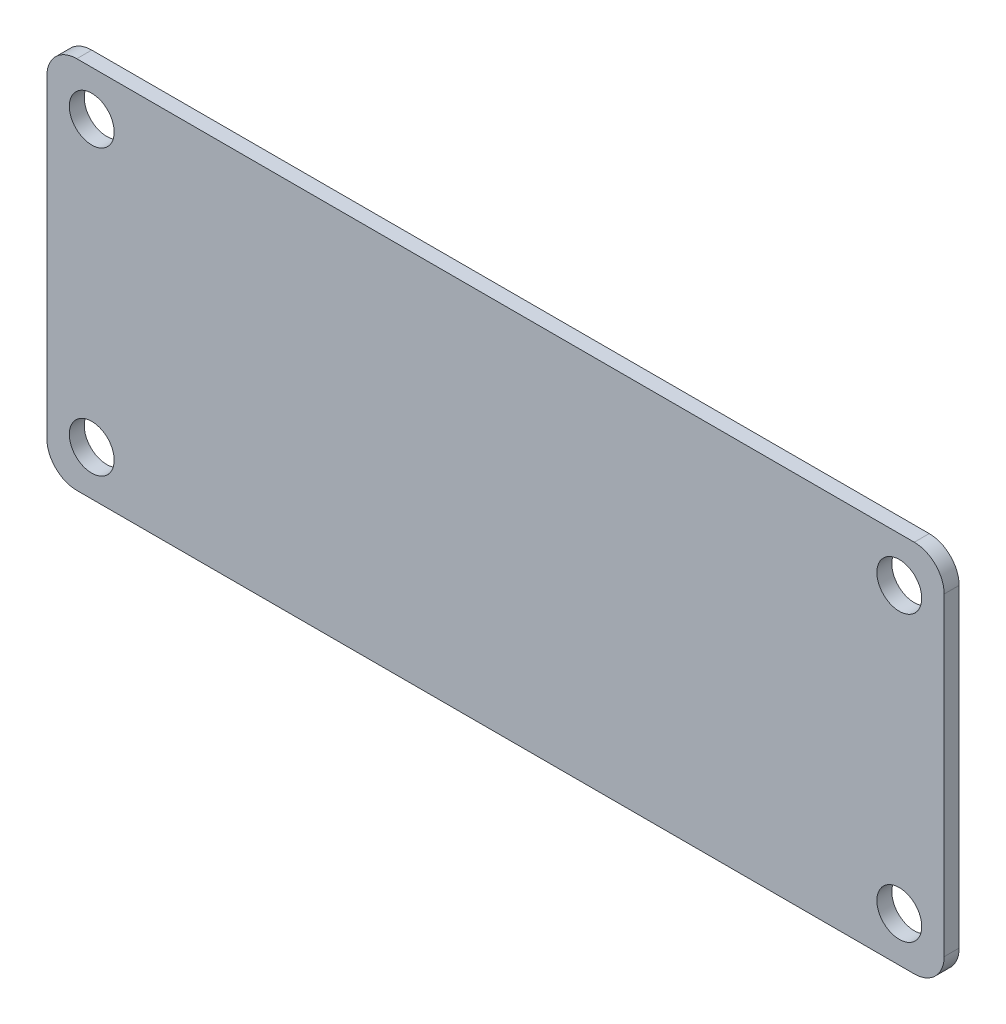
ISO-10303-21;
HEADER;
FILE_DESCRIPTION(('STEP AP214'),'2;1');
FILE_NAME('part.step','',(''),(''),'','','');
FILE_SCHEMA(('AUTOMOTIVE_DESIGN { 1 0 10303 214 1 1 1 1 }'));
ENDSEC;
DATA;
#1=APPLICATION_CONTEXT('core data for automotive mechanical design processes');
#2=APPLICATION_PROTOCOL_DEFINITION('international standard','automotive_design',2000,#1);
#3=PRODUCT_CONTEXT('',#1,'mechanical');
#4=PRODUCT('Part','Part','',(#3));
#5=PRODUCT_RELATED_PRODUCT_CATEGORY('part','',(#4));
#6=PRODUCT_DEFINITION_FORMATION('','',#4);
#7=PRODUCT_DEFINITION_CONTEXT('part definition',#1,'design');
#8=PRODUCT_DEFINITION('design','',#6,#7);
#9=PRODUCT_DEFINITION_SHAPE('','',#8);
#10=(LENGTH_UNIT() NAMED_UNIT(*) SI_UNIT(.MILLI.,.METRE.));
#11=(NAMED_UNIT(*) PLANE_ANGLE_UNIT() SI_UNIT($,.RADIAN.));
#12=(NAMED_UNIT(*) SI_UNIT($,.STERADIAN.) SOLID_ANGLE_UNIT());
#13=UNCERTAINTY_MEASURE_WITH_UNIT(LENGTH_MEASURE(1.E-05),#10,'distance_accuracy_value','');
#14=(GEOMETRIC_REPRESENTATION_CONTEXT(3) GLOBAL_UNCERTAINTY_ASSIGNED_CONTEXT((#13)) GLOBAL_UNIT_ASSIGNED_CONTEXT((#10,
#11,#12)) REPRESENTATION_CONTEXT('',''));
#15=CARTESIAN_POINT('',(0.,0.,0.));
#16=DIRECTION('',(0.,0.,1.));
#17=DIRECTION('',(1.,0.,0.));
#18=AXIS2_PLACEMENT_3D('',#15,#16,#17);
#19=CARTESIAN_POINT('',(-30.,12.5,1.));
#20=DIRECTION('',(1.,0.,0.));
#21=DIRECTION('',(0.,1.,0.));
#22=AXIS2_PLACEMENT_3D('',#19,#20,#21);
#23=PLANE('',#22);
#24=DIRECTION('',(0.,-1.,0.));
#25=VECTOR('',#24,1.);
#26=CARTESIAN_POINT('',(-30.,12.5,0.));
#27=LINE('',#26,#25);
#28=CARTESIAN_POINT('',(-30.,10.5,0.));
#29=VERTEX_POINT('',#28);
#30=CARTESIAN_POINT('',(-30.,-10.5,0.));
#31=VERTEX_POINT('',#30);
#32=EDGE_CURVE('E129',#29,#31,#27,.T.);
#33=ORIENTED_EDGE('',*,*,#32,.T.);
#34=DIRECTION('',(0.,0.,-1.));
#35=VECTOR('',#34,1.);
#36=CARTESIAN_POINT('',(-30.,-10.5,1.));
#37=LINE('',#36,#35);
#38=CARTESIAN_POINT('',(-30.,-10.5,1.));
#39=VERTEX_POINT('',#38);
#40=EDGE_CURVE('E11',#31,#39,#37,.F.);
#41=ORIENTED_EDGE('',*,*,#40,.T.);
#42=DIRECTION('',(0.,-1.,0.));
#43=VECTOR('',#42,1.);
#44=CARTESIAN_POINT('',(-30.,12.5,1.));
#45=LINE('',#44,#43);
#46=CARTESIAN_POINT('',(-30.,10.5,1.));
#47=VERTEX_POINT('',#46);
#48=EDGE_CURVE('E127',#47,#39,#45,.T.);
#49=ORIENTED_EDGE('',*,*,#48,.F.);
#50=DIRECTION('',(0.,0.,-1.));
#51=VECTOR('',#50,1.);
#52=CARTESIAN_POINT('',(-30.,10.5,1.));
#53=LINE('',#52,#51);
#54=EDGE_CURVE('E41',#47,#29,#53,.T.);
#55=ORIENTED_EDGE('',*,*,#54,.T.);
#56=EDGE_LOOP('',(#33,#41,#49,#55));
#57=FACE_BOUND('',#56,.T.);
#58=ADVANCED_FACE('F33',(#57),#23,.F.);
#59=CARTESIAN_POINT('',(-30.,-12.5,1.));
#60=DIRECTION('',(0.,1.,0.));
#61=DIRECTION('',(0.,0.,1.));
#62=AXIS2_PLACEMENT_3D('',#59,#60,#61);
#63=PLANE('',#62);
#64=DIRECTION('',(1.,0.,0.));
#65=VECTOR('',#64,1.);
#66=CARTESIAN_POINT('',(-30.,-12.5,0.));
#67=LINE('',#66,#65);
#68=CARTESIAN_POINT('',(-28.,-12.5,0.));
#69=VERTEX_POINT('',#68);
#70=CARTESIAN_POINT('',(28.,-12.5,0.));
#71=VERTEX_POINT('',#70);
#72=EDGE_CURVE('E125',#69,#71,#67,.T.);
#73=ORIENTED_EDGE('',*,*,#72,.T.);
#74=DIRECTION('',(0.,0.,-1.));
#75=VECTOR('',#74,1.);
#76=CARTESIAN_POINT('',(28.,-12.5,1.));
#77=LINE('',#76,#75);
#78=CARTESIAN_POINT('',(28.,-12.5,1.));
#79=VERTEX_POINT('',#78);
#80=EDGE_CURVE('E104',#71,#79,#77,.F.);
#81=ORIENTED_EDGE('',*,*,#80,.T.);
#82=DIRECTION('',(1.,0.,0.));
#83=VECTOR('',#82,1.);
#84=CARTESIAN_POINT('',(-30.,-12.5,1.));
#85=LINE('',#84,#83);
#86=CARTESIAN_POINT('',(-28.,-12.5,1.));
#87=VERTEX_POINT('',#86);
#88=EDGE_CURVE('E169',#87,#79,#85,.T.);
#89=ORIENTED_EDGE('',*,*,#88,.F.);
#90=DIRECTION('',(0.,0.,-1.));
#91=VECTOR('',#90,1.);
#92=CARTESIAN_POINT('',(-28.,-12.5,1.));
#93=LINE('',#92,#91);
#94=EDGE_CURVE('E109',#87,#69,#93,.T.);
#95=ORIENTED_EDGE('',*,*,#94,.T.);
#96=EDGE_LOOP('',(#73,#81,#89,#95));
#97=FACE_BOUND('',#96,.T.);
#98=ADVANCED_FACE('F217',(#97),#63,.F.);
#99=CARTESIAN_POINT('',(30.,12.5,1.));
#100=DIRECTION('',(-1.,0.,0.));
#101=DIRECTION('',(0.,-1.,0.));
#102=AXIS2_PLACEMENT_3D('',#99,#100,#101);
#103=PLANE('',#102);
#104=DIRECTION('',(0.,1.,0.));
#105=VECTOR('',#104,1.);
#106=CARTESIAN_POINT('',(30.,12.5,1.));
#107=LINE('',#106,#105);
#108=CARTESIAN_POINT('',(30.,-10.5,1.));
#109=VERTEX_POINT('',#108);
#110=CARTESIAN_POINT('',(30.,10.5,1.));
#111=VERTEX_POINT('',#110);
#112=EDGE_CURVE('E118',#109,#111,#107,.T.);
#113=ORIENTED_EDGE('',*,*,#112,.F.);
#114=DIRECTION('',(0.,0.,-1.));
#115=VECTOR('',#114,1.);
#116=CARTESIAN_POINT('',(30.,-10.5,1.));
#117=LINE('',#116,#115);
#118=CARTESIAN_POINT('',(30.,-10.5,0.));
#119=VERTEX_POINT('',#118);
#120=EDGE_CURVE('E103',#109,#119,#117,.T.);
#121=ORIENTED_EDGE('',*,*,#120,.T.);
#122=DIRECTION('',(0.,1.,0.));
#123=VECTOR('',#122,1.);
#124=CARTESIAN_POINT('',(30.,12.5,0.));
#125=LINE('',#124,#123);
#126=CARTESIAN_POINT('',(30.,10.5,0.));
#127=VERTEX_POINT('',#126);
#128=EDGE_CURVE('E116',#119,#127,#125,.T.);
#129=ORIENTED_EDGE('',*,*,#128,.T.);
#130=DIRECTION('',(0.,0.,-1.));
#131=VECTOR('',#130,1.);
#132=CARTESIAN_POINT('',(30.,10.5,1.));
#133=LINE('',#132,#131);
#134=EDGE_CURVE('E120',#127,#111,#133,.F.);
#135=ORIENTED_EDGE('',*,*,#134,.T.);
#136=EDGE_LOOP('',(#113,#121,#129,#135));
#137=FACE_BOUND('',#136,.T.);
#138=ADVANCED_FACE('F115',(#137),#103,.F.);
#139=CARTESIAN_POINT('',(-30.,12.5,1.));
#140=DIRECTION('',(0.,-1.,0.));
#141=DIRECTION('',(0.,0.,-1.));
#142=AXIS2_PLACEMENT_3D('',#139,#140,#141);
#143=PLANE('',#142);
#144=DIRECTION('',(-1.,0.,0.));
#145=VECTOR('',#144,1.);
#146=CARTESIAN_POINT('',(-30.,12.5,1.));
#147=LINE('',#146,#145);
#148=CARTESIAN_POINT('',(28.,12.5,1.));
#149=VERTEX_POINT('',#148);
#150=CARTESIAN_POINT('',(-28.,12.5,1.));
#151=VERTEX_POINT('',#150);
#152=EDGE_CURVE('E133',#149,#151,#147,.T.);
#153=ORIENTED_EDGE('',*,*,#152,.F.);
#154=DIRECTION('',(0.,0.,-1.));
#155=VECTOR('',#154,1.);
#156=CARTESIAN_POINT('',(28.,12.5,1.));
#157=LINE('',#156,#155);
#158=CARTESIAN_POINT('',(28.,12.5,0.));
#159=VERTEX_POINT('',#158);
#160=EDGE_CURVE('E150',#149,#159,#157,.T.);
#161=ORIENTED_EDGE('',*,*,#160,.T.);
#162=DIRECTION('',(-1.,0.,0.));
#163=VECTOR('',#162,1.);
#164=CARTESIAN_POINT('',(-30.,12.5,0.));
#165=LINE('',#164,#163);
#166=CARTESIAN_POINT('',(-28.,12.5,0.));
#167=VERTEX_POINT('',#166);
#168=EDGE_CURVE('E124',#159,#167,#165,.T.);
#169=ORIENTED_EDGE('',*,*,#168,.T.);
#170=DIRECTION('',(0.,0.,-1.));
#171=VECTOR('',#170,1.);
#172=CARTESIAN_POINT('',(-28.,12.5,1.));
#173=LINE('',#172,#171);
#174=EDGE_CURVE('E48',#167,#151,#173,.F.);
#175=ORIENTED_EDGE('',*,*,#174,.T.);
#176=EDGE_LOOP('',(#153,#161,#169,#175));
#177=FACE_BOUND('',#176,.T.);
#178=ADVANCED_FACE('F206',(#177),#143,.F.);
#179=CARTESIAN_POINT('',(0.,0.,1.));
#180=DIRECTION('',(0.,0.,1.));
#181=DIRECTION('',(1.,0.,0.));
#182=AXIS2_PLACEMENT_3D('',#179,#180,#181);
#183=PLANE('',#182);
#184=CARTESIAN_POINT('',(27.,9.5,1.));
#185=DIRECTION('',(0.,0.,1.));
#186=DIRECTION('',(1.,0.,0.));
#187=AXIS2_PLACEMENT_3D('',#184,#185,#186);
#188=CIRCLE('',#187,1.5);
#189=CARTESIAN_POINT('',(28.5,9.5,1.));
#190=VERTEX_POINT('',#189);
#191=EDGE_CURVE('E188',#190,#190,#188,.T.);
#192=ORIENTED_EDGE('',*,*,#191,.F.);
#193=EDGE_LOOP('',(#192));
#194=FACE_BOUND('',#193,.T.);
#195=CARTESIAN_POINT('',(-27.,-9.5,1.));
#196=DIRECTION('',(0.,0.,1.));
#197=DIRECTION('',(1.,0.,0.));
#198=AXIS2_PLACEMENT_3D('',#195,#196,#197);
#199=CIRCLE('',#198,1.5);
#200=CARTESIAN_POINT('',(-25.5,-9.5,1.));
#201=VERTEX_POINT('',#200);
#202=EDGE_CURVE('E182',#201,#201,#199,.T.);
#203=ORIENTED_EDGE('',*,*,#202,.F.);
#204=EDGE_LOOP('',(#203));
#205=FACE_BOUND('',#204,.T.);
#206=CARTESIAN_POINT('',(27.,-9.5,1.));
#207=DIRECTION('',(0.,0.,1.));
#208=DIRECTION('',(1.,0.,0.));
#209=AXIS2_PLACEMENT_3D('',#206,#207,#208);
#210=CIRCLE('',#209,1.5);
#211=CARTESIAN_POINT('',(28.5,-9.5,1.));
#212=VERTEX_POINT('',#211);
#213=EDGE_CURVE('E176',#212,#212,#210,.T.);
#214=ORIENTED_EDGE('',*,*,#213,.F.);
#215=EDGE_LOOP('',(#214));
#216=FACE_BOUND('',#215,.T.);
#217=CARTESIAN_POINT('',(-27.,9.5,1.));
#218=DIRECTION('',(0.,0.,1.));
#219=DIRECTION('',(1.,0.,0.));
#220=AXIS2_PLACEMENT_3D('',#217,#218,#219);
#221=CIRCLE('',#220,1.5);
#222=CARTESIAN_POINT('',(-25.5,9.5,1.));
#223=VERTEX_POINT('',#222);
#224=EDGE_CURVE('E164',#223,#223,#221,.T.);
#225=ORIENTED_EDGE('',*,*,#224,.F.);
#226=EDGE_LOOP('',(#225));
#227=FACE_BOUND('',#226,.T.);
#228=ORIENTED_EDGE('',*,*,#88,.T.);
#229=CARTESIAN_POINT('',(28.,-10.5,1.));
#230=DIRECTION('',(0.,0.,1.));
#231=DIRECTION('',(1.,0.,0.));
#232=AXIS2_PLACEMENT_3D('',#229,#230,#231);
#233=CIRCLE('',#232,2.);
#234=EDGE_CURVE('E147',#79,#109,#233,.T.);
#235=ORIENTED_EDGE('',*,*,#234,.T.);
#236=ORIENTED_EDGE('',*,*,#112,.T.);
#237=CARTESIAN_POINT('',(28.,10.5,1.));
#238=DIRECTION('',(0.,0.,1.));
#239=DIRECTION('',(1.,0.,0.));
#240=AXIS2_PLACEMENT_3D('',#237,#238,#239);
#241=CIRCLE('',#240,2.);
#242=EDGE_CURVE('E55',#111,#149,#241,.T.);
#243=ORIENTED_EDGE('',*,*,#242,.T.);
#244=ORIENTED_EDGE('',*,*,#152,.T.);
#245=CARTESIAN_POINT('',(-28.,10.5,1.));
#246=DIRECTION('',(0.,0.,1.));
#247=DIRECTION('',(1.,0.,0.));
#248=AXIS2_PLACEMENT_3D('',#245,#246,#247);
#249=CIRCLE('',#248,2.);
#250=EDGE_CURVE('E142',#151,#47,#249,.T.);
#251=ORIENTED_EDGE('',*,*,#250,.T.);
#252=ORIENTED_EDGE('',*,*,#48,.T.);
#253=CARTESIAN_POINT('',(-28.,-10.5,1.));
#254=DIRECTION('',(0.,0.,1.));
#255=DIRECTION('',(1.,0.,0.));
#256=AXIS2_PLACEMENT_3D('',#253,#254,#255);
#257=CIRCLE('',#256,2.);
#258=EDGE_CURVE('E144',#39,#87,#257,.T.);
#259=ORIENTED_EDGE('',*,*,#258,.T.);
#260=EDGE_LOOP('',(#228,#235,#236,#243,#244,#251,#252,#259));
#261=FACE_BOUND('',#260,.T.);
#262=ADVANCED_FACE('F203',(#194,#205,#216,#227,#261),#183,.T.);
#263=CARTESIAN_POINT('',(0.,0.,0.));
#264=DIRECTION('',(0.,0.,1.));
#265=DIRECTION('',(1.,0.,0.));
#266=AXIS2_PLACEMENT_3D('',#263,#264,#265);
#267=PLANE('',#266);
#268=CARTESIAN_POINT('',(27.,9.5,0.));
#269=DIRECTION('',(0.,0.,1.));
#270=DIRECTION('',(1.,0.,0.));
#271=AXIS2_PLACEMENT_3D('',#268,#269,#270);
#272=CIRCLE('',#271,1.5);
#273=CARTESIAN_POINT('',(28.5,9.5,0.));
#274=VERTEX_POINT('',#273);
#275=EDGE_CURVE('E174',#274,#274,#272,.T.);
#276=ORIENTED_EDGE('',*,*,#275,.T.);
#277=EDGE_LOOP('',(#276));
#278=FACE_BOUND('',#277,.T.);
#279=CARTESIAN_POINT('',(-27.,-9.5,0.));
#280=DIRECTION('',(0.,0.,1.));
#281=DIRECTION('',(1.,0.,0.));
#282=AXIS2_PLACEMENT_3D('',#279,#280,#281);
#283=CIRCLE('',#282,1.5);
#284=CARTESIAN_POINT('',(-25.5,-9.5,0.));
#285=VERTEX_POINT('',#284);
#286=EDGE_CURVE('E185',#285,#285,#283,.T.);
#287=ORIENTED_EDGE('',*,*,#286,.T.);
#288=EDGE_LOOP('',(#287));
#289=FACE_BOUND('',#288,.T.);
#290=CARTESIAN_POINT('',(27.,-9.5,0.));
#291=DIRECTION('',(0.,0.,1.));
#292=DIRECTION('',(1.,0.,0.));
#293=AXIS2_PLACEMENT_3D('',#290,#291,#292);
#294=CIRCLE('',#293,1.5);
#295=CARTESIAN_POINT('',(28.5,-9.5,0.));
#296=VERTEX_POINT('',#295);
#297=EDGE_CURVE('E179',#296,#296,#294,.T.);
#298=ORIENTED_EDGE('',*,*,#297,.T.);
#299=EDGE_LOOP('',(#298));
#300=FACE_BOUND('',#299,.T.);
#301=CARTESIAN_POINT('',(-27.,9.5,0.));
#302=DIRECTION('',(0.,0.,1.));
#303=DIRECTION('',(1.,0.,0.));
#304=AXIS2_PLACEMENT_3D('',#301,#302,#303);
#305=CIRCLE('',#304,1.5);
#306=CARTESIAN_POINT('',(-25.5,9.5,0.));
#307=VERTEX_POINT('',#306);
#308=EDGE_CURVE('E162',#307,#307,#305,.T.);
#309=ORIENTED_EDGE('',*,*,#308,.T.);
#310=EDGE_LOOP('',(#309));
#311=FACE_BOUND('',#310,.T.);
#312=ORIENTED_EDGE('',*,*,#128,.F.);
#313=CARTESIAN_POINT('',(28.,-10.5,0.));
#314=DIRECTION('',(0.,0.,1.));
#315=DIRECTION('',(1.,0.,0.));
#316=AXIS2_PLACEMENT_3D('',#313,#314,#315);
#317=CIRCLE('',#316,2.);
#318=EDGE_CURVE('E99',#119,#71,#317,.F.);
#319=ORIENTED_EDGE('',*,*,#318,.T.);
#320=ORIENTED_EDGE('',*,*,#72,.F.);
#321=CARTESIAN_POINT('',(-28.,-10.5,0.));
#322=DIRECTION('',(0.,0.,1.));
#323=DIRECTION('',(1.,0.,0.));
#324=AXIS2_PLACEMENT_3D('',#321,#322,#323);
#325=CIRCLE('',#324,2.);
#326=EDGE_CURVE('E136',#69,#31,#325,.F.);
#327=ORIENTED_EDGE('',*,*,#326,.T.);
#328=ORIENTED_EDGE('',*,*,#32,.F.);
#329=CARTESIAN_POINT('',(-28.,10.5,0.));
#330=DIRECTION('',(0.,0.,1.));
#331=DIRECTION('',(1.,0.,0.));
#332=AXIS2_PLACEMENT_3D('',#329,#330,#331);
#333=CIRCLE('',#332,2.);
#334=EDGE_CURVE('E119',#29,#167,#333,.F.);
#335=ORIENTED_EDGE('',*,*,#334,.T.);
#336=ORIENTED_EDGE('',*,*,#168,.F.);
#337=CARTESIAN_POINT('',(28.,10.5,0.));
#338=DIRECTION('',(0.,0.,1.));
#339=DIRECTION('',(1.,0.,0.));
#340=AXIS2_PLACEMENT_3D('',#337,#338,#339);
#341=CIRCLE('',#340,2.);
#342=EDGE_CURVE('E110',#159,#127,#341,.F.);
#343=ORIENTED_EDGE('',*,*,#342,.T.);
#344=EDGE_LOOP('',(#312,#319,#320,#327,#328,#335,#336,#343));
#345=FACE_BOUND('',#344,.T.);
#346=ADVANCED_FACE('F122',(#278,#289,#300,#311,#345),#267,.F.);
#347=CARTESIAN_POINT('',(-27.,9.5,0.));
#348=DIRECTION('',(0.,0.,1.));
#349=DIRECTION('',(1.,0.,0.));
#350=AXIS2_PLACEMENT_3D('',#347,#348,#349);
#351=CYLINDRICAL_SURFACE('',#350,1.5);
#352=ORIENTED_EDGE('',*,*,#308,.F.);
#353=EDGE_LOOP('',(#352));
#354=FACE_BOUND('',#353,.T.);
#355=ORIENTED_EDGE('',*,*,#224,.T.);
#356=EDGE_LOOP('',(#355));
#357=FACE_BOUND('',#356,.T.);
#358=ADVANCED_FACE('F247',(#354,#357),#351,.F.);
#359=CARTESIAN_POINT('',(27.,-9.5,0.));
#360=DIRECTION('',(0.,0.,1.));
#361=DIRECTION('',(1.,0.,0.));
#362=AXIS2_PLACEMENT_3D('',#359,#360,#361);
#363=CYLINDRICAL_SURFACE('',#362,1.5);
#364=ORIENTED_EDGE('',*,*,#297,.F.);
#365=EDGE_LOOP('',(#364));
#366=FACE_BOUND('',#365,.T.);
#367=ORIENTED_EDGE('',*,*,#213,.T.);
#368=EDGE_LOOP('',(#367));
#369=FACE_BOUND('',#368,.T.);
#370=ADVANCED_FACE('F251',(#366,#369),#363,.F.);
#371=CARTESIAN_POINT('',(-27.,-9.5,0.));
#372=DIRECTION('',(0.,0.,1.));
#373=DIRECTION('',(1.,0.,0.));
#374=AXIS2_PLACEMENT_3D('',#371,#372,#373);
#375=CYLINDRICAL_SURFACE('',#374,1.5);
#376=ORIENTED_EDGE('',*,*,#286,.F.);
#377=EDGE_LOOP('',(#376));
#378=FACE_BOUND('',#377,.T.);
#379=ORIENTED_EDGE('',*,*,#202,.T.);
#380=EDGE_LOOP('',(#379));
#381=FACE_BOUND('',#380,.T.);
#382=ADVANCED_FACE('F199',(#378,#381),#375,.F.);
#383=CARTESIAN_POINT('',(27.,9.5,0.));
#384=DIRECTION('',(0.,0.,1.));
#385=DIRECTION('',(1.,0.,0.));
#386=AXIS2_PLACEMENT_3D('',#383,#384,#385);
#387=CYLINDRICAL_SURFACE('',#386,1.5);
#388=ORIENTED_EDGE('',*,*,#275,.F.);
#389=EDGE_LOOP('',(#388));
#390=FACE_BOUND('',#389,.T.);
#391=ORIENTED_EDGE('',*,*,#191,.T.);
#392=EDGE_LOOP('',(#391));
#393=FACE_BOUND('',#392,.T.);
#394=ADVANCED_FACE('F196',(#390,#393),#387,.F.);
#395=CARTESIAN_POINT('',(28.,-10.5,1.));
#396=DIRECTION('',(0.,0.,-1.));
#397=DIRECTION('',(-1.,0.,0.));
#398=AXIS2_PLACEMENT_3D('',#395,#396,#397);
#399=CYLINDRICAL_SURFACE('',#398,2.);
#400=ORIENTED_EDGE('',*,*,#234,.F.);
#401=ORIENTED_EDGE('',*,*,#80,.F.);
#402=ORIENTED_EDGE('',*,*,#318,.F.);
#403=ORIENTED_EDGE('',*,*,#120,.F.);
#404=EDGE_LOOP('',(#400,#401,#402,#403));
#405=FACE_BOUND('',#404,.T.);
#406=ADVANCED_FACE('F102',(#405),#399,.T.);
#407=CARTESIAN_POINT('',(28.,10.5,1.));
#408=DIRECTION('',(0.,0.,-1.));
#409=DIRECTION('',(-1.,0.,0.));
#410=AXIS2_PLACEMENT_3D('',#407,#408,#409);
#411=CYLINDRICAL_SURFACE('',#410,2.);
#412=ORIENTED_EDGE('',*,*,#242,.F.);
#413=ORIENTED_EDGE('',*,*,#134,.F.);
#414=ORIENTED_EDGE('',*,*,#342,.F.);
#415=ORIENTED_EDGE('',*,*,#160,.F.);
#416=EDGE_LOOP('',(#412,#413,#414,#415));
#417=FACE_BOUND('',#416,.T.);
#418=ADVANCED_FACE('F224',(#417),#411,.T.);
#419=CARTESIAN_POINT('',(-28.,-10.5,1.));
#420=DIRECTION('',(0.,0.,-1.));
#421=DIRECTION('',(-1.,0.,0.));
#422=AXIS2_PLACEMENT_3D('',#419,#420,#421);
#423=CYLINDRICAL_SURFACE('',#422,2.);
#424=ORIENTED_EDGE('',*,*,#258,.F.);
#425=ORIENTED_EDGE('',*,*,#40,.F.);
#426=ORIENTED_EDGE('',*,*,#326,.F.);
#427=ORIENTED_EDGE('',*,*,#94,.F.);
#428=EDGE_LOOP('',(#424,#425,#426,#427));
#429=FACE_BOUND('',#428,.T.);
#430=ADVANCED_FACE('F219',(#429),#423,.T.);
#431=CARTESIAN_POINT('',(-28.,10.5,1.));
#432=DIRECTION('',(0.,0.,-1.));
#433=DIRECTION('',(-1.,0.,0.));
#434=AXIS2_PLACEMENT_3D('',#431,#432,#433);
#435=CYLINDRICAL_SURFACE('',#434,2.);
#436=ORIENTED_EDGE('',*,*,#250,.F.);
#437=ORIENTED_EDGE('',*,*,#174,.F.);
#438=ORIENTED_EDGE('',*,*,#334,.F.);
#439=ORIENTED_EDGE('',*,*,#54,.F.);
#440=EDGE_LOOP('',(#436,#437,#438,#439));
#441=FACE_BOUND('',#440,.T.);
#442=ADVANCED_FACE('F35',(#441),#435,.T.);
#443=CLOSED_SHELL('',(#58,#98,#138,#178,#262,#346,#358,#370,#382,#394,#406,#418,#430,#442));
#444=MANIFOLD_SOLID_BREP('B2',#443);
#445=ADVANCED_BREP_SHAPE_REPRESENTATION('',(#18,#444),#14);
#446=SHAPE_DEFINITION_REPRESENTATION(#9,#445);
ENDSEC;
END-ISO-10303-21;
